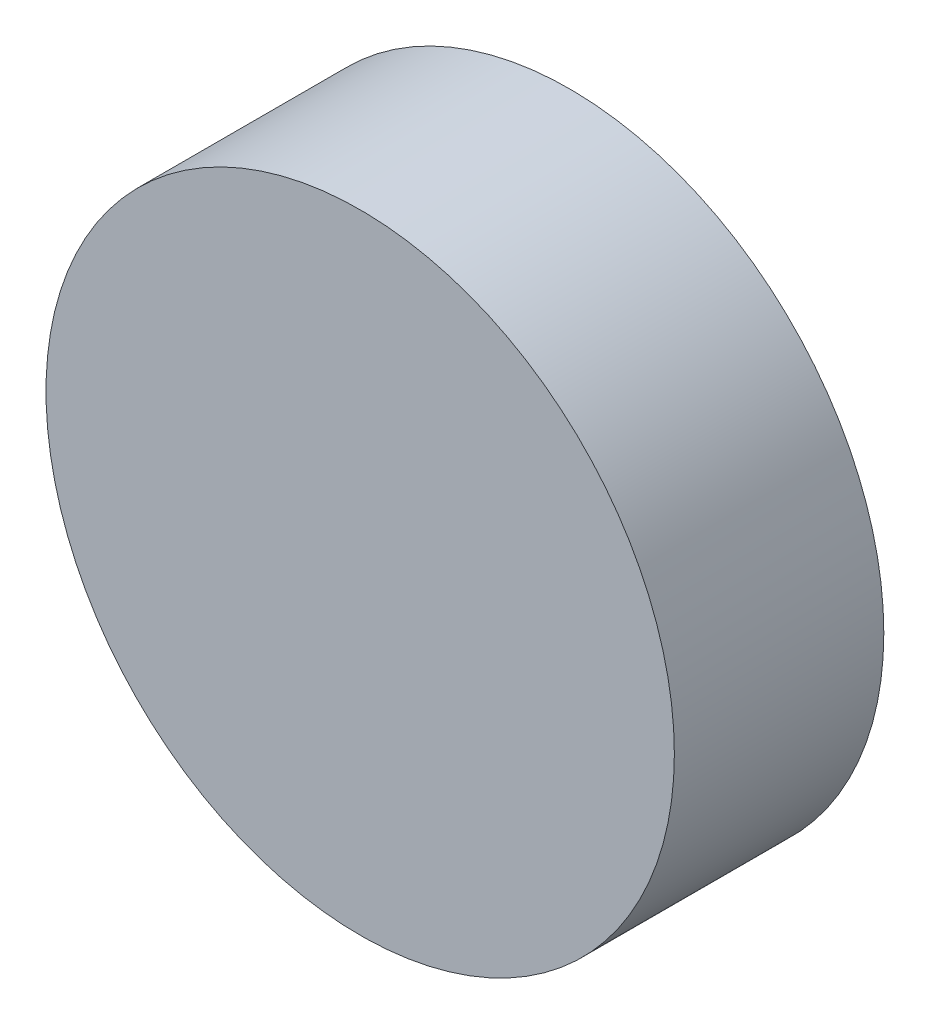
ISO-10303-21;
HEADER;
FILE_DESCRIPTION(('STEP AP214'),'2;1');
FILE_NAME('part.step','',(''),(''),'','','');
FILE_SCHEMA(('AUTOMOTIVE_DESIGN { 1 0 10303 214 1 1 1 1 }'));
ENDSEC;
DATA;
#1=APPLICATION_CONTEXT('core data for automotive mechanical design processes');
#2=APPLICATION_PROTOCOL_DEFINITION('international standard','automotive_design',2000,#1);
#3=PRODUCT_CONTEXT('',#1,'mechanical');
#4=PRODUCT('Part','Part','',(#3));
#5=PRODUCT_RELATED_PRODUCT_CATEGORY('part','',(#4));
#6=PRODUCT_DEFINITION_FORMATION('','',#4);
#7=PRODUCT_DEFINITION_CONTEXT('part definition',#1,'design');
#8=PRODUCT_DEFINITION('design','',#6,#7);
#9=PRODUCT_DEFINITION_SHAPE('','',#8);
#10=(LENGTH_UNIT() NAMED_UNIT(*) SI_UNIT(.MILLI.,.METRE.));
#11=(NAMED_UNIT(*) PLANE_ANGLE_UNIT() SI_UNIT($,.RADIAN.));
#12=(NAMED_UNIT(*) SI_UNIT($,.STERADIAN.) SOLID_ANGLE_UNIT());
#13=UNCERTAINTY_MEASURE_WITH_UNIT(LENGTH_MEASURE(1.E-05),#10,'distance_accuracy_value','');
#14=(GEOMETRIC_REPRESENTATION_CONTEXT(3) GLOBAL_UNCERTAINTY_ASSIGNED_CONTEXT((#13)) GLOBAL_UNIT_ASSIGNED_CONTEXT((#10,
#11,#12)) REPRESENTATION_CONTEXT('',''));
#15=CARTESIAN_POINT('',(0.,0.,0.));
#16=DIRECTION('',(0.,0.,1.));
#17=DIRECTION('',(1.,0.,0.));
#18=AXIS2_PLACEMENT_3D('',#15,#16,#17);
#19=CARTESIAN_POINT('',(0.,0.,1.5875));
#20=DIRECTION('',(0.,0.,-1.));
#21=DIRECTION('',(-1.,0.,0.));
#22=AXIS2_PLACEMENT_3D('',#19,#20,#21);
#23=CYLINDRICAL_SURFACE('',#22,2.38125);
#24=CARTESIAN_POINT('',(0.,0.,1.5875));
#25=DIRECTION('',(0.,0.,1.));
#26=DIRECTION('',(1.,0.,0.));
#27=AXIS2_PLACEMENT_3D('',#24,#25,#26);
#28=CIRCLE('',#27,2.38125);
#29=CARTESIAN_POINT('',(2.38125,0.,1.5875));
#30=VERTEX_POINT('',#29);
#31=EDGE_CURVE('E10',#30,#30,#28,.T.);
#32=ORIENTED_EDGE('',*,*,#31,.F.);
#33=EDGE_LOOP('',(#32));
#34=FACE_BOUND('',#33,.T.);
#35=CARTESIAN_POINT('',(0.,0.,0.));
#36=DIRECTION('',(0.,0.,1.));
#37=DIRECTION('',(1.,0.,0.));
#38=AXIS2_PLACEMENT_3D('',#35,#36,#37);
#39=CIRCLE('',#38,2.38125);
#40=CARTESIAN_POINT('',(2.38125,0.,0.));
#41=VERTEX_POINT('',#40);
#42=EDGE_CURVE('E34',#41,#41,#39,.T.);
#43=ORIENTED_EDGE('',*,*,#42,.T.);
#44=EDGE_LOOP('',(#43));
#45=FACE_BOUND('',#44,.T.);
#46=ADVANCED_FACE('F31',(#34,#45),#23,.T.);
#47=CARTESIAN_POINT('',(0.,0.,1.5875));
#48=DIRECTION('',(0.,0.,1.));
#49=DIRECTION('',(1.,0.,0.));
#50=AXIS2_PLACEMENT_3D('',#47,#48,#49);
#51=PLANE('',#50);
#52=ORIENTED_EDGE('',*,*,#31,.T.);
#53=EDGE_LOOP('',(#52));
#54=FACE_BOUND('',#53,.T.);
#55=ADVANCED_FACE('F46',(#54),#51,.T.);
#56=CARTESIAN_POINT('',(0.,0.,0.));
#57=DIRECTION('',(0.,0.,1.));
#58=DIRECTION('',(1.,0.,0.));
#59=AXIS2_PLACEMENT_3D('',#56,#57,#58);
#60=PLANE('',#59);
#61=ORIENTED_EDGE('',*,*,#42,.F.);
#62=EDGE_LOOP('',(#61));
#63=FACE_BOUND('',#62,.T.);
#64=ADVANCED_FACE('F44',(#63),#60,.F.);
#65=CLOSED_SHELL('',(#46,#55,#64));
#66=MANIFOLD_SOLID_BREP('B2',#65);
#67=ADVANCED_BREP_SHAPE_REPRESENTATION('',(#18,#66),#14);
#68=SHAPE_DEFINITION_REPRESENTATION(#9,#67);
ENDSEC;
END-ISO-10303-21;
